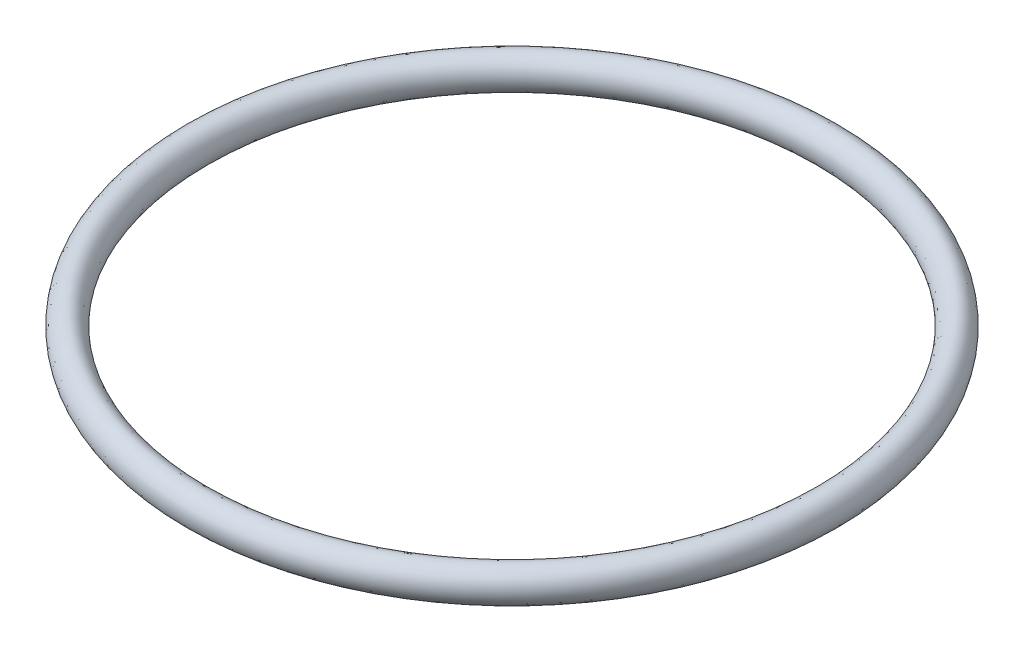
ISO-10303-21;
HEADER;
FILE_DESCRIPTION(('STEP AP214'),'2;1');
FILE_NAME('part.step','',(''),(''),'','','');
FILE_SCHEMA(('AUTOMOTIVE_DESIGN { 1 0 10303 214 1 1 1 1 }'));
ENDSEC;
DATA;
#1=APPLICATION_CONTEXT('core data for automotive mechanical design processes');
#2=APPLICATION_PROTOCOL_DEFINITION('international standard','automotive_design',2000,#1);
#3=PRODUCT_CONTEXT('',#1,'mechanical');
#4=PRODUCT('Part','Part','',(#3));
#5=PRODUCT_RELATED_PRODUCT_CATEGORY('part','',(#4));
#6=PRODUCT_DEFINITION_FORMATION('','',#4);
#7=PRODUCT_DEFINITION_CONTEXT('part definition',#1,'design');
#8=PRODUCT_DEFINITION('design','',#6,#7);
#9=PRODUCT_DEFINITION_SHAPE('','',#8);
#10=(LENGTH_UNIT() NAMED_UNIT(*) SI_UNIT(.MILLI.,.METRE.));
#11=(NAMED_UNIT(*) PLANE_ANGLE_UNIT() SI_UNIT($,.RADIAN.));
#12=(NAMED_UNIT(*) SI_UNIT($,.STERADIAN.) SOLID_ANGLE_UNIT());
#13=UNCERTAINTY_MEASURE_WITH_UNIT(LENGTH_MEASURE(1.E-05),#10,'distance_accuracy_value','');
#14=(GEOMETRIC_REPRESENTATION_CONTEXT(3) GLOBAL_UNCERTAINTY_ASSIGNED_CONTEXT((#13)) GLOBAL_UNIT_ASSIGNED_CONTEXT((#10,
#11,#12)) REPRESENTATION_CONTEXT('',''));
#15=CARTESIAN_POINT('',(0.,0.,0.));
#16=DIRECTION('',(0.,0.,1.));
#17=DIRECTION('',(1.,0.,0.));
#18=AXIS2_PLACEMENT_3D('',#15,#16,#17);
#19=CARTESIAN_POINT('',(-35.15,0.,0.));
#20=DIRECTION('',(0.,0.,1.));
#21=DIRECTION('',(0.,1.,0.));
#22=AXIS2_PLACEMENT_3D('',#19,#20,#21);
#23=ELLIPSE('',#22,1.9,1.7);
#24=CARTESIAN_POINT('',(0.,0.,0.));
#25=DIRECTION('',(0.,-1.,0.));
#26=AXIS1_PLACEMENT('',#24,#25);
#27=SURFACE_OF_REVOLUTION('',#23,#26);
#28=ADVANCED_FACE('F42',(),#27,.T.);
#29=CLOSED_SHELL('',(#28));
#30=MANIFOLD_SOLID_BREP('B2',#29);
#31=ADVANCED_BREP_SHAPE_REPRESENTATION('',(#18,#30),#14);
#32=SHAPE_DEFINITION_REPRESENTATION(#9,#31);
ENDSEC;
END-ISO-10303-21;
